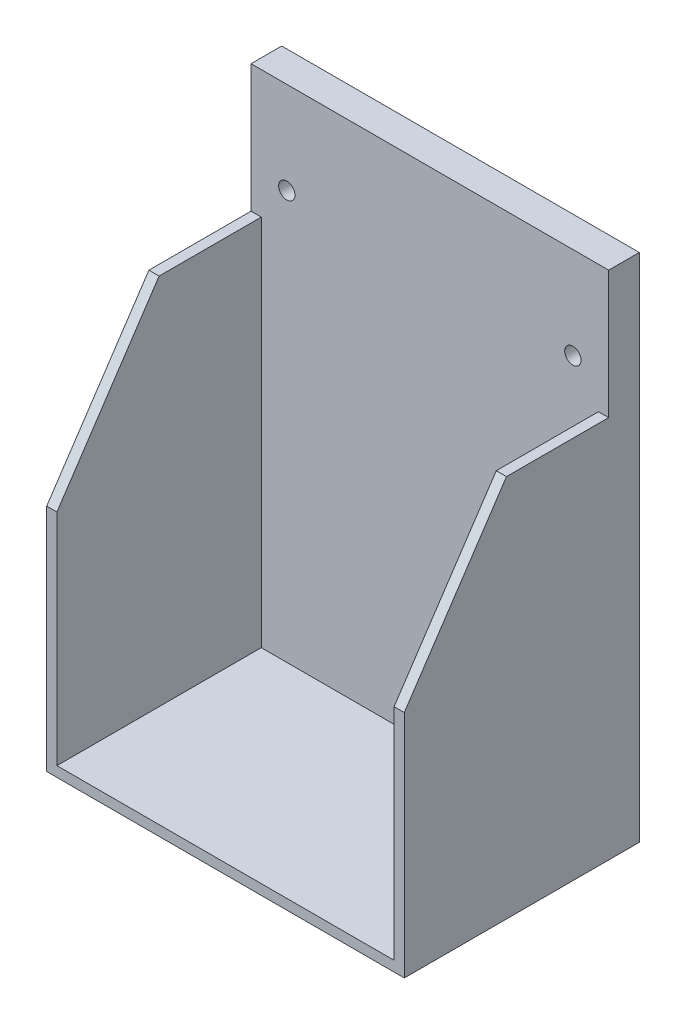
ISO-10303-21;
HEADER;
FILE_DESCRIPTION(('STEP AP214'),'2;1');
FILE_NAME('part.step','',(''),(''),'','','');
FILE_SCHEMA(('AUTOMOTIVE_DESIGN { 1 0 10303 214 1 1 1 1 }'));
ENDSEC;
DATA;
#1=APPLICATION_CONTEXT('core data for automotive mechanical design processes');
#2=APPLICATION_PROTOCOL_DEFINITION('international standard','automotive_design',2000,#1);
#3=PRODUCT_CONTEXT('',#1,'mechanical');
#4=PRODUCT('Part','Part','',(#3));
#5=PRODUCT_RELATED_PRODUCT_CATEGORY('part','',(#4));
#6=PRODUCT_DEFINITION_FORMATION('','',#4);
#7=PRODUCT_DEFINITION_CONTEXT('part definition',#1,'design');
#8=PRODUCT_DEFINITION('design','',#6,#7);
#9=PRODUCT_DEFINITION_SHAPE('','',#8);
#10=(LENGTH_UNIT() NAMED_UNIT(*) SI_UNIT(.MILLI.,.METRE.));
#11=(NAMED_UNIT(*) PLANE_ANGLE_UNIT() SI_UNIT($,.RADIAN.));
#12=(NAMED_UNIT(*) SI_UNIT($,.STERADIAN.) SOLID_ANGLE_UNIT());
#13=UNCERTAINTY_MEASURE_WITH_UNIT(LENGTH_MEASURE(1.E-05),#10,'distance_accuracy_value','');
#14=(GEOMETRIC_REPRESENTATION_CONTEXT(3) GLOBAL_UNCERTAINTY_ASSIGNED_CONTEXT((#13)) GLOBAL_UNIT_ASSIGNED_CONTEXT((#10,
#11,#12)) REPRESENTATION_CONTEXT('',''));
#15=CARTESIAN_POINT('',(0.,0.,0.));
#16=DIRECTION('',(0.,0.,1.));
#17=DIRECTION('',(1.,0.,0.));
#18=AXIS2_PLACEMENT_3D('',#15,#16,#17);
#19=CARTESIAN_POINT('',(0.,0.,6.));
#20=DIRECTION('',(0.,0.,1.));
#21=DIRECTION('',(1.,0.,0.));
#22=AXIS2_PLACEMENT_3D('',#19,#20,#21);
#23=PLANE('',#22);
#24=DIRECTION('',(-1.,0.,0.));
#25=VECTOR('',#24,1.);
#26=CARTESIAN_POINT('',(0.,-7.14102564102563,6.));
#27=LINE('',#26,#25);
#28=CARTESIAN_POINT('',(49.,-7.14102564102563,6.));
#29=VERTEX_POINT('',#28);
#30=CARTESIAN_POINT('',(47.,-7.14102564102563,6.));
#31=VERTEX_POINT('',#30);
#32=EDGE_CURVE('E225',#29,#31,#27,.T.);
#33=ORIENTED_EDGE('',*,*,#32,.F.);
#34=DIRECTION('',(0.,1.,0.));
#35=VECTOR('',#34,1.);
#36=CARTESIAN_POINT('',(49.,17.8589743589744,6.));
#37=LINE('',#36,#35);
#38=CARTESIAN_POINT('',(49.,17.8589743589744,6.));
#39=VERTEX_POINT('',#38);
#40=EDGE_CURVE('E153',#29,#39,#37,.T.);
#41=ORIENTED_EDGE('',*,*,#40,.T.);
#42=DIRECTION('',(-1.,0.,0.));
#43=VECTOR('',#42,1.);
#44=CARTESIAN_POINT('',(-21.,17.8589743589744,6.));
#45=LINE('',#44,#43);
#46=CARTESIAN_POINT('',(-21.,17.8589743589744,6.));
#47=VERTEX_POINT('',#46);
#48=EDGE_CURVE('E184',#39,#47,#45,.T.);
#49=ORIENTED_EDGE('',*,*,#48,.T.);
#50=DIRECTION('',(0.,-1.,0.));
#51=VECTOR('',#50,1.);
#52=CARTESIAN_POINT('',(-21.,17.8589743589744,6.));
#53=LINE('',#52,#51);
#54=CARTESIAN_POINT('',(-21.,-7.14102564102563,6.));
#55=VERTEX_POINT('',#54);
#56=EDGE_CURVE('E179',#47,#55,#53,.T.);
#57=ORIENTED_EDGE('',*,*,#56,.T.);
#58=DIRECTION('',(1.,0.,0.));
#59=VECTOR('',#58,1.);
#60=CARTESIAN_POINT('',(0.,-7.14102564102563,6.));
#61=LINE('',#60,#59);
#62=CARTESIAN_POINT('',(-19.,-7.14102564102563,6.));
#63=VERTEX_POINT('',#62);
#64=EDGE_CURVE('E229',#55,#63,#61,.T.);
#65=ORIENTED_EDGE('',*,*,#64,.T.);
#66=DIRECTION('',(0.,-1.,0.));
#67=VECTOR('',#66,1.);
#68=CARTESIAN_POINT('',(-19.,0.,6.));
#69=LINE('',#68,#67);
#70=CARTESIAN_POINT('',(-19.,-80.1410256410256,6.));
#71=VERTEX_POINT('',#70);
#72=EDGE_CURVE('E233',#63,#71,#69,.T.);
#73=ORIENTED_EDGE('',*,*,#72,.T.);
#74=DIRECTION('',(1.,0.,0.));
#75=VECTOR('',#74,1.);
#76=CARTESIAN_POINT('',(0.,-80.1410256410256,6.));
#77=LINE('',#76,#75);
#78=CARTESIAN_POINT('',(47.,-80.1410256410256,6.));
#79=VERTEX_POINT('',#78);
#80=EDGE_CURVE('E248',#71,#79,#77,.T.);
#81=ORIENTED_EDGE('',*,*,#80,.T.);
#82=DIRECTION('',(0.,-1.,0.));
#83=VECTOR('',#82,1.);
#84=CARTESIAN_POINT('',(47.,0.,6.));
#85=LINE('',#84,#83);
#86=EDGE_CURVE('E228',#31,#79,#85,.T.);
#87=ORIENTED_EDGE('',*,*,#86,.F.);
#88=EDGE_LOOP('',(#33,#41,#49,#57,#65,#73,#81,#87));
#89=FACE_BOUND('',#88,.T.);
#90=CARTESIAN_POINT('',(-14.,-0.141025641025631,6.));
#91=DIRECTION('',(0.,0.,1.));
#92=DIRECTION('',(1.,0.,0.));
#93=AXIS2_PLACEMENT_3D('',#90,#91,#92);
#94=CIRCLE('',#93,1.6);
#95=CARTESIAN_POINT('',(-12.4,-0.141025641025631,6.));
#96=VERTEX_POINT('',#95);
#97=EDGE_CURVE('E173',#96,#96,#94,.T.);
#98=ORIENTED_EDGE('',*,*,#97,.F.);
#99=EDGE_LOOP('',(#98));
#100=FACE_BOUND('',#99,.T.);
#101=CARTESIAN_POINT('',(42.,-0.141025641025624,6.));
#102=DIRECTION('',(0.,0.,1.));
#103=DIRECTION('',(-1.,0.,0.));
#104=AXIS2_PLACEMENT_3D('',#101,#102,#103);
#105=CIRCLE('',#104,1.6);
#106=CARTESIAN_POINT('',(40.4,-0.141025641025624,6.));
#107=VERTEX_POINT('',#106);
#108=EDGE_CURVE('E167',#107,#107,#105,.T.);
#109=ORIENTED_EDGE('',*,*,#108,.F.);
#110=EDGE_LOOP('',(#109));
#111=FACE_BOUND('',#110,.T.);
#112=ADVANCED_FACE('F45',(#89,#100,#111),#23,.T.);
#113=CARTESIAN_POINT('',(0.,0.,0.));
#114=DIRECTION('',(0.,0.,1.));
#115=DIRECTION('',(1.,0.,0.));
#116=AXIS2_PLACEMENT_3D('',#113,#114,#115);
#117=PLANE('',#116);
#118=DIRECTION('',(0.,-1.,0.));
#119=VECTOR('',#118,1.);
#120=CARTESIAN_POINT('',(-21.,17.8589743589744,0.));
#121=LINE('',#120,#119);
#122=CARTESIAN_POINT('',(-21.,17.8589743589744,0.));
#123=VERTEX_POINT('',#122);
#124=CARTESIAN_POINT('',(-21.,-82.1410256410256,0.));
#125=VERTEX_POINT('',#124);
#126=EDGE_CURVE('E176',#123,#125,#121,.T.);
#127=ORIENTED_EDGE('',*,*,#126,.F.);
#128=DIRECTION('',(-1.,0.,0.));
#129=VECTOR('',#128,1.);
#130=CARTESIAN_POINT('',(-21.,17.8589743589744,0.));
#131=LINE('',#130,#129);
#132=CARTESIAN_POINT('',(49.,17.8589743589744,0.));
#133=VERTEX_POINT('',#132);
#134=EDGE_CURVE('E182',#133,#123,#131,.T.);
#135=ORIENTED_EDGE('',*,*,#134,.F.);
#136=DIRECTION('',(0.,1.,0.));
#137=VECTOR('',#136,1.);
#138=CARTESIAN_POINT('',(49.,17.8589743589744,0.));
#139=LINE('',#138,#137);
#140=CARTESIAN_POINT('',(49.,-82.1410256410256,0.));
#141=VERTEX_POINT('',#140);
#142=EDGE_CURVE('E191',#141,#133,#139,.T.);
#143=ORIENTED_EDGE('',*,*,#142,.F.);
#144=DIRECTION('',(1.,0.,0.));
#145=VECTOR('',#144,1.);
#146=CARTESIAN_POINT('',(-21.,-82.1410256410256,0.));
#147=LINE('',#146,#145);
#148=EDGE_CURVE('E189',#125,#141,#147,.T.);
#149=ORIENTED_EDGE('',*,*,#148,.F.);
#150=EDGE_LOOP('',(#127,#135,#143,#149));
#151=FACE_BOUND('',#150,.T.);
#152=CARTESIAN_POINT('',(-14.,-0.141025641025631,0.));
#153=DIRECTION('',(0.,0.,1.));
#154=DIRECTION('',(1.,0.,0.));
#155=AXIS2_PLACEMENT_3D('',#152,#153,#154);
#156=CIRCLE('',#155,1.6);
#157=CARTESIAN_POINT('',(-12.4,-0.141025641025631,0.));
#158=VERTEX_POINT('',#157);
#159=EDGE_CURVE('E170',#158,#158,#156,.T.);
#160=ORIENTED_EDGE('',*,*,#159,.T.);
#161=EDGE_LOOP('',(#160));
#162=FACE_BOUND('',#161,.T.);
#163=CARTESIAN_POINT('',(42.,-0.141025641025624,0.));
#164=DIRECTION('',(0.,0.,1.));
#165=DIRECTION('',(-1.,0.,0.));
#166=AXIS2_PLACEMENT_3D('',#163,#164,#165);
#167=CIRCLE('',#166,1.6);
#168=CARTESIAN_POINT('',(40.4,-0.141025641025624,0.));
#169=VERTEX_POINT('',#168);
#170=EDGE_CURVE('E166',#169,#169,#167,.T.);
#171=ORIENTED_EDGE('',*,*,#170,.T.);
#172=EDGE_LOOP('',(#171));
#173=FACE_BOUND('',#172,.T.);
#174=ADVANCED_FACE('F215',(#151,#162,#173),#117,.F.);
#175=CARTESIAN_POINT('',(-21.,17.8589743589744,6.));
#176=DIRECTION('',(1.,0.,0.));
#177=DIRECTION('',(0.,1.,0.));
#178=AXIS2_PLACEMENT_3D('',#175,#176,#177);
#179=PLANE('',#178);
#180=DIRECTION('',(0.,-1.,0.));
#181=VECTOR('',#180,1.);
#182=CARTESIAN_POINT('',(-21.,0.,46.));
#183=LINE('',#182,#181);
#184=CARTESIAN_POINT('',(-21.,-37.1410256410256,46.));
#185=VERTEX_POINT('',#184);
#186=CARTESIAN_POINT('',(-21.,-82.1410256410256,46.));
#187=VERTEX_POINT('',#186);
#188=EDGE_CURVE('E263',#185,#187,#183,.T.);
#189=ORIENTED_EDGE('',*,*,#188,.F.);
#190=DIRECTION('',(0.,-0.832050294337844,0.554700196225229));
#191=VECTOR('',#190,1.);
#192=CARTESIAN_POINT('',(-21.,-7.14102564102563,26.));
#193=LINE('',#192,#191);
#194=CARTESIAN_POINT('',(-21.,-7.14102564102563,26.));
#195=VERTEX_POINT('',#194);
#196=EDGE_CURVE('E67',#195,#185,#193,.T.);
#197=ORIENTED_EDGE('',*,*,#196,.F.);
#198=DIRECTION('',(0.,0.,-1.));
#199=VECTOR('',#198,1.);
#200=CARTESIAN_POINT('',(-21.,-7.14102564102563,46.));
#201=LINE('',#200,#199);
#202=EDGE_CURVE('E154',#195,#55,#201,.T.);
#203=ORIENTED_EDGE('',*,*,#202,.T.);
#204=ORIENTED_EDGE('',*,*,#56,.F.);
#205=DIRECTION('',(0.,0.,-1.));
#206=VECTOR('',#205,1.);
#207=CARTESIAN_POINT('',(-21.,17.8589743589744,6.));
#208=LINE('',#207,#206);
#209=EDGE_CURVE('E186',#47,#123,#208,.T.);
#210=ORIENTED_EDGE('',*,*,#209,.T.);
#211=ORIENTED_EDGE('',*,*,#126,.T.);
#212=DIRECTION('',(0.,0.,-1.));
#213=VECTOR('',#212,1.);
#214=CARTESIAN_POINT('',(-21.,-82.1410256410256,6.));
#215=LINE('',#214,#213);
#216=EDGE_CURVE('E53',#187,#125,#215,.T.);
#217=ORIENTED_EDGE('',*,*,#216,.F.);
#218=EDGE_LOOP('',(#189,#197,#203,#204,#210,#211,#217));
#219=FACE_BOUND('',#218,.T.);
#220=ADVANCED_FACE('F47',(#219),#179,.F.);
#221=CARTESIAN_POINT('',(-21.,-82.1410256410256,6.));
#222=DIRECTION('',(0.,1.,0.));
#223=DIRECTION('',(0.,0.,1.));
#224=AXIS2_PLACEMENT_3D('',#221,#222,#223);
#225=PLANE('',#224);
#226=ORIENTED_EDGE('',*,*,#148,.T.);
#227=DIRECTION('',(0.,0.,-1.));
#228=VECTOR('',#227,1.);
#229=CARTESIAN_POINT('',(49.,-82.1410256410256,6.));
#230=LINE('',#229,#228);
#231=CARTESIAN_POINT('',(49.,-82.1410256410256,46.));
#232=VERTEX_POINT('',#231);
#233=EDGE_CURVE('E199',#232,#141,#230,.T.);
#234=ORIENTED_EDGE('',*,*,#233,.F.);
#235=DIRECTION('',(1.,0.,0.));
#236=VECTOR('',#235,1.);
#237=CARTESIAN_POINT('',(0.,-82.1410256410256,46.));
#238=LINE('',#237,#236);
#239=EDGE_CURVE('E207',#187,#232,#238,.T.);
#240=ORIENTED_EDGE('',*,*,#239,.F.);
#241=ORIENTED_EDGE('',*,*,#216,.T.);
#242=EDGE_LOOP('',(#226,#234,#240,#241));
#243=FACE_BOUND('',#242,.T.);
#244=ADVANCED_FACE('F205',(#243),#225,.F.);
#245=CARTESIAN_POINT('',(49.,17.8589743589744,6.));
#246=DIRECTION('',(-1.,0.,0.));
#247=DIRECTION('',(0.,-1.,0.));
#248=AXIS2_PLACEMENT_3D('',#245,#246,#247);
#249=PLANE('',#248);
#250=DIRECTION('',(0.,0.,-1.));
#251=VECTOR('',#250,1.);
#252=CARTESIAN_POINT('',(49.,-7.14102564102563,46.));
#253=LINE('',#252,#251);
#254=CARTESIAN_POINT('',(49.,-7.14102564102562,26.));
#255=VERTEX_POINT('',#254);
#256=EDGE_CURVE('E146',#255,#29,#253,.T.);
#257=ORIENTED_EDGE('',*,*,#256,.F.);
#258=DIRECTION('',(0.,-0.832050294337844,0.554700196225229));
#259=VECTOR('',#258,1.);
#260=CARTESIAN_POINT('',(49.,-7.14102564102562,26.));
#261=LINE('',#260,#259);
#262=CARTESIAN_POINT('',(49.,-37.1410256410256,46.));
#263=VERTEX_POINT('',#262);
#264=EDGE_CURVE('E131',#255,#263,#261,.T.);
#265=ORIENTED_EDGE('',*,*,#264,.T.);
#266=DIRECTION('',(0.,1.,0.));
#267=VECTOR('',#266,1.);
#268=CARTESIAN_POINT('',(49.,0.,46.));
#269=LINE('',#268,#267);
#270=EDGE_CURVE('E240',#232,#263,#269,.T.);
#271=ORIENTED_EDGE('',*,*,#270,.F.);
#272=ORIENTED_EDGE('',*,*,#233,.T.);
#273=ORIENTED_EDGE('',*,*,#142,.T.);
#274=DIRECTION('',(0.,0.,-1.));
#275=VECTOR('',#274,1.);
#276=CARTESIAN_POINT('',(49.,17.8589743589744,6.));
#277=LINE('',#276,#275);
#278=EDGE_CURVE('E196',#39,#133,#277,.T.);
#279=ORIENTED_EDGE('',*,*,#278,.F.);
#280=ORIENTED_EDGE('',*,*,#40,.F.);
#281=EDGE_LOOP('',(#257,#265,#271,#272,#273,#279,#280));
#282=FACE_BOUND('',#281,.T.);
#283=ADVANCED_FACE('F151',(#282),#249,.F.);
#284=CARTESIAN_POINT('',(-21.,17.8589743589744,6.));
#285=DIRECTION('',(0.,-1.,0.));
#286=DIRECTION('',(0.,0.,-1.));
#287=AXIS2_PLACEMENT_3D('',#284,#285,#286);
#288=PLANE('',#287);
#289=ORIENTED_EDGE('',*,*,#134,.T.);
#290=ORIENTED_EDGE('',*,*,#209,.F.);
#291=ORIENTED_EDGE('',*,*,#48,.F.);
#292=ORIENTED_EDGE('',*,*,#278,.T.);
#293=EDGE_LOOP('',(#289,#290,#291,#292));
#294=FACE_BOUND('',#293,.T.);
#295=ADVANCED_FACE('F220',(#294),#288,.F.);
#296=CARTESIAN_POINT('',(-14.,-0.141025641025631,6.));
#297=DIRECTION('',(0.,0.,-1.));
#298=DIRECTION('',(-1.,0.,0.));
#299=AXIS2_PLACEMENT_3D('',#296,#297,#298);
#300=CYLINDRICAL_SURFACE('',#299,1.6);
#301=ORIENTED_EDGE('',*,*,#97,.T.);
#302=EDGE_LOOP('',(#301));
#303=FACE_BOUND('',#302,.T.);
#304=ORIENTED_EDGE('',*,*,#159,.F.);
#305=EDGE_LOOP('',(#304));
#306=FACE_BOUND('',#305,.T.);
#307=ADVANCED_FACE('F293',(#303,#306),#300,.F.);
#308=CARTESIAN_POINT('',(42.,-0.141025641025624,6.));
#309=DIRECTION('',(0.,0.,-1.));
#310=DIRECTION('',(-1.,0.,0.));
#311=AXIS2_PLACEMENT_3D('',#308,#309,#310);
#312=CYLINDRICAL_SURFACE('',#311,1.6);
#313=ORIENTED_EDGE('',*,*,#108,.T.);
#314=EDGE_LOOP('',(#313));
#315=FACE_BOUND('',#314,.T.);
#316=ORIENTED_EDGE('',*,*,#170,.F.);
#317=EDGE_LOOP('',(#316));
#318=FACE_BOUND('',#317,.T.);
#319=ADVANCED_FACE('F367',(#315,#318),#312,.F.);
#320=CARTESIAN_POINT('',(0.,-80.1410256410256,46.));
#321=DIRECTION('',(0.,1.,0.));
#322=DIRECTION('',(0.,0.,1.));
#323=AXIS2_PLACEMENT_3D('',#320,#321,#322);
#324=PLANE('',#323);
#325=ORIENTED_EDGE('',*,*,#80,.F.);
#326=DIRECTION('',(0.,0.,-1.));
#327=VECTOR('',#326,1.);
#328=CARTESIAN_POINT('',(-19.,-80.1410256410256,46.));
#329=LINE('',#328,#327);
#330=CARTESIAN_POINT('',(-19.,-80.1410256410256,46.));
#331=VERTEX_POINT('',#330);
#332=EDGE_CURVE('E163',#331,#71,#329,.T.);
#333=ORIENTED_EDGE('',*,*,#332,.F.);
#334=DIRECTION('',(1.,0.,0.));
#335=VECTOR('',#334,1.);
#336=CARTESIAN_POINT('',(0.,-80.1410256410256,46.));
#337=LINE('',#336,#335);
#338=CARTESIAN_POINT('',(47.,-80.1410256410256,46.));
#339=VERTEX_POINT('',#338);
#340=EDGE_CURVE('E231',#331,#339,#337,.T.);
#341=ORIENTED_EDGE('',*,*,#340,.T.);
#342=DIRECTION('',(0.,0.,-1.));
#343=VECTOR('',#342,1.);
#344=CARTESIAN_POINT('',(47.,-80.1410256410256,46.));
#345=LINE('',#344,#343);
#346=EDGE_CURVE('E158',#339,#79,#345,.T.);
#347=ORIENTED_EDGE('',*,*,#346,.T.);
#348=EDGE_LOOP('',(#325,#333,#341,#347));
#349=FACE_BOUND('',#348,.T.);
#350=ADVANCED_FACE('F260',(#349),#324,.T.);
#351=CARTESIAN_POINT('',(-19.,0.,46.));
#352=DIRECTION('',(1.,0.,0.));
#353=DIRECTION('',(0.,1.,0.));
#354=AXIS2_PLACEMENT_3D('',#351,#352,#353);
#355=PLANE('',#354);
#356=DIRECTION('',(0.,0.832050294337844,-0.554700196225229));
#357=VECTOR('',#356,1.);
#358=CARTESIAN_POINT('',(-19.,-11.4280078895464,28.8579881656805));
#359=LINE('',#358,#357);
#360=CARTESIAN_POINT('',(-19.,-37.1410256410256,46.));
#361=VERTEX_POINT('',#360);
#362=CARTESIAN_POINT('',(-19.,-7.14102564102563,26.));
#363=VERTEX_POINT('',#362);
#364=EDGE_CURVE('E249',#361,#363,#359,.T.);
#365=ORIENTED_EDGE('',*,*,#364,.F.);
#366=DIRECTION('',(0.,-1.,0.));
#367=VECTOR('',#366,1.);
#368=CARTESIAN_POINT('',(-19.,0.,46.));
#369=LINE('',#368,#367);
#370=EDGE_CURVE('E259',#361,#331,#369,.T.);
#371=ORIENTED_EDGE('',*,*,#370,.T.);
#372=ORIENTED_EDGE('',*,*,#332,.T.);
#373=ORIENTED_EDGE('',*,*,#72,.F.);
#374=DIRECTION('',(0.,0.,-1.));
#375=VECTOR('',#374,1.);
#376=CARTESIAN_POINT('',(-19.,-7.14102564102563,46.));
#377=LINE('',#376,#375);
#378=EDGE_CURVE('E156',#363,#63,#377,.T.);
#379=ORIENTED_EDGE('',*,*,#378,.F.);
#380=EDGE_LOOP('',(#365,#371,#372,#373,#379));
#381=FACE_BOUND('',#380,.T.);
#382=ADVANCED_FACE('F256',(#381),#355,.T.);
#383=CARTESIAN_POINT('',(0.,-7.14102564102563,46.));
#384=DIRECTION('',(0.,1.,0.));
#385=DIRECTION('',(0.,0.,1.));
#386=AXIS2_PLACEMENT_3D('',#383,#384,#385);
#387=PLANE('',#386);
#388=DIRECTION('',(-1.,0.,0.));
#389=VECTOR('',#388,1.);
#390=CARTESIAN_POINT('',(49.,-7.14102564102562,26.));
#391=LINE('',#390,#389);
#392=EDGE_CURVE('E140',#363,#195,#391,.T.);
#393=ORIENTED_EDGE('',*,*,#392,.F.);
#394=ORIENTED_EDGE('',*,*,#378,.T.);
#395=ORIENTED_EDGE('',*,*,#64,.F.);
#396=ORIENTED_EDGE('',*,*,#202,.F.);
#397=EDGE_LOOP('',(#393,#394,#395,#396));
#398=FACE_BOUND('',#397,.T.);
#399=ADVANCED_FACE('F272',(#398),#387,.T.);
#400=CARTESIAN_POINT('',(0.,-7.14102564102563,46.));
#401=DIRECTION('',(0.,-1.,0.));
#402=DIRECTION('',(0.,0.,-1.));
#403=AXIS2_PLACEMENT_3D('',#400,#401,#402);
#404=PLANE('',#403);
#405=DIRECTION('',(0.,0.,-1.));
#406=VECTOR('',#405,1.);
#407=CARTESIAN_POINT('',(47.,-7.14102564102563,46.));
#408=LINE('',#407,#406);
#409=CARTESIAN_POINT('',(47.,-7.14102564102562,26.));
#410=VERTEX_POINT('',#409);
#411=EDGE_CURVE('E148',#410,#31,#408,.T.);
#412=ORIENTED_EDGE('',*,*,#411,.F.);
#413=EDGE_CURVE('E134',#255,#410,#391,.T.);
#414=ORIENTED_EDGE('',*,*,#413,.F.);
#415=ORIENTED_EDGE('',*,*,#256,.T.);
#416=ORIENTED_EDGE('',*,*,#32,.T.);
#417=EDGE_LOOP('',(#412,#414,#415,#416));
#418=FACE_BOUND('',#417,.T.);
#419=ADVANCED_FACE('F144',(#418),#404,.F.);
#420=CARTESIAN_POINT('',(47.,0.,46.));
#421=DIRECTION('',(1.,0.,0.));
#422=DIRECTION('',(0.,1.,0.));
#423=AXIS2_PLACEMENT_3D('',#420,#421,#422);
#424=PLANE('',#423);
#425=DIRECTION('',(0.,-1.,0.));
#426=VECTOR('',#425,1.);
#427=CARTESIAN_POINT('',(47.,0.,46.));
#428=LINE('',#427,#426);
#429=CARTESIAN_POINT('',(47.,-37.1410256410256,46.));
#430=VERTEX_POINT('',#429);
#431=EDGE_CURVE('E236',#430,#339,#428,.T.);
#432=ORIENTED_EDGE('',*,*,#431,.F.);
#433=DIRECTION('',(0.,0.832050294337844,-0.554700196225229));
#434=VECTOR('',#433,1.);
#435=CARTESIAN_POINT('',(47.,-11.4280078895463,28.8579881656805));
#436=LINE('',#435,#434);
#437=EDGE_CURVE('E60',#430,#410,#436,.T.);
#438=ORIENTED_EDGE('',*,*,#437,.T.);
#439=ORIENTED_EDGE('',*,*,#411,.T.);
#440=ORIENTED_EDGE('',*,*,#86,.T.);
#441=ORIENTED_EDGE('',*,*,#346,.F.);
#442=EDGE_LOOP('',(#432,#438,#439,#440,#441));
#443=FACE_BOUND('',#442,.T.);
#444=ADVANCED_FACE('F275',(#443),#424,.F.);
#445=CARTESIAN_POINT('',(0.,0.,46.));
#446=DIRECTION('',(0.,0.,1.));
#447=DIRECTION('',(1.,0.,0.));
#448=AXIS2_PLACEMENT_3D('',#445,#446,#447);
#449=PLANE('',#448);
#450=DIRECTION('',(1.,0.,0.));
#451=VECTOR('',#450,1.);
#452=CARTESIAN_POINT('',(0.,-37.1410256410256,46.));
#453=LINE('',#452,#451);
#454=EDGE_CURVE('E11',#185,#361,#453,.T.);
#455=ORIENTED_EDGE('',*,*,#454,.F.);
#456=ORIENTED_EDGE('',*,*,#188,.T.);
#457=ORIENTED_EDGE('',*,*,#239,.T.);
#458=ORIENTED_EDGE('',*,*,#270,.T.);
#459=DIRECTION('',(-1.,0.,0.));
#460=VECTOR('',#459,1.);
#461=CARTESIAN_POINT('',(49.,-37.1410256410256,46.));
#462=LINE('',#461,#460);
#463=EDGE_CURVE('E135',#263,#430,#462,.T.);
#464=ORIENTED_EDGE('',*,*,#463,.T.);
#465=ORIENTED_EDGE('',*,*,#431,.T.);
#466=ORIENTED_EDGE('',*,*,#340,.F.);
#467=ORIENTED_EDGE('',*,*,#370,.F.);
#468=EDGE_LOOP('',(#455,#456,#457,#458,#464,#465,#466,#467));
#469=FACE_BOUND('',#468,.T.);
#470=ADVANCED_FACE('F261',(#469),#449,.T.);
#471=CARTESIAN_POINT('',(49.,-7.14102564102562,26.));
#472=DIRECTION('',(0.,-0.554700196225229,-0.832050294337844));
#473=DIRECTION('',(0.,0.832050294337844,-0.554700196225229));
#474=AXIS2_PLACEMENT_3D('',#471,#472,#473);
#475=PLANE('',#474);
#476=ORIENTED_EDGE('',*,*,#463,.F.);
#477=ORIENTED_EDGE('',*,*,#264,.F.);
#478=ORIENTED_EDGE('',*,*,#413,.T.);
#479=ORIENTED_EDGE('',*,*,#437,.F.);
#480=EDGE_LOOP('',(#476,#477,#478,#479));
#481=FACE_BOUND('',#480,.T.);
#482=ADVANCED_FACE('F133',(#481),#475,.F.);
#483=ORIENTED_EDGE('',*,*,#364,.T.);
#484=ORIENTED_EDGE('',*,*,#392,.T.);
#485=ORIENTED_EDGE('',*,*,#196,.T.);
#486=ORIENTED_EDGE('',*,*,#454,.T.);
#487=EDGE_LOOP('',(#483,#484,#485,#486));
#488=FACE_BOUND('',#487,.T.);
#489=ADVANCED_FACE('F352',(#488),#475,.F.);
#490=CLOSED_SHELL('',(#112,#174,#220,#244,#283,#295,#307,#319,#350,#382,#399,#419,#444,#470,
#482,#489));
#491=MANIFOLD_SOLID_BREP('B2',#490);
#492=ADVANCED_BREP_SHAPE_REPRESENTATION('',(#18,#491),#14);
#493=SHAPE_DEFINITION_REPRESENTATION(#9,#492);
ENDSEC;
END-ISO-10303-21;
